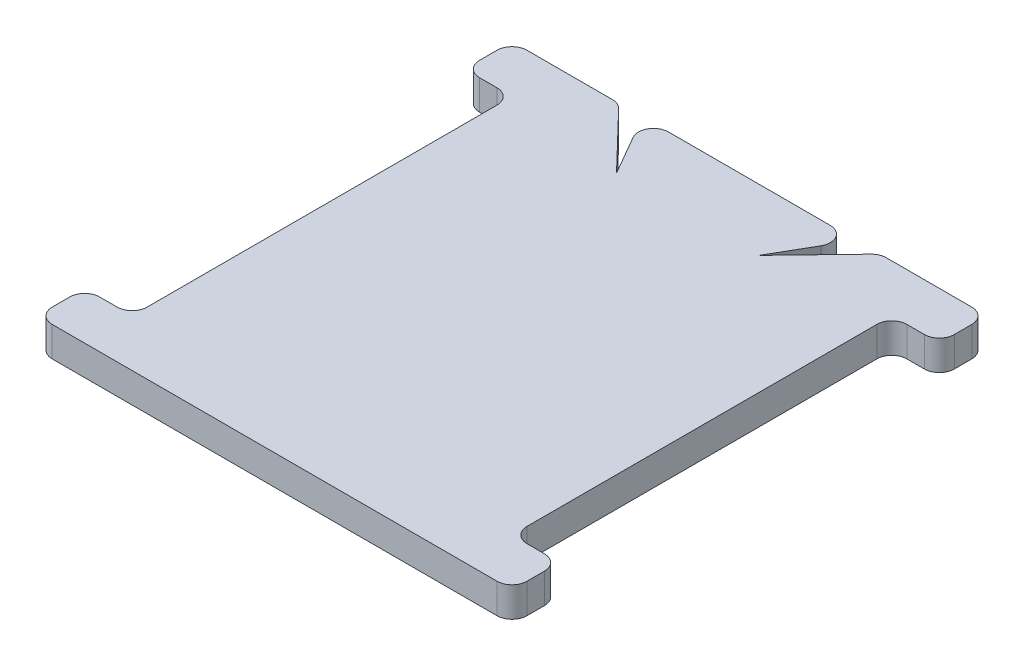
ISO-10303-21;
HEADER;
FILE_DESCRIPTION(('STEP AP214'),'2;1');
FILE_NAME('part.step','',(''),(''),'','','');
FILE_SCHEMA(('AUTOMOTIVE_DESIGN { 1 0 10303 214 1 1 1 1 }'));
ENDSEC;
DATA;
#1=APPLICATION_CONTEXT('core data for automotive mechanical design processes');
#2=APPLICATION_PROTOCOL_DEFINITION('international standard','automotive_design',2000,#1);
#3=PRODUCT_CONTEXT('',#1,'mechanical');
#4=PRODUCT('Part','Part','',(#3));
#5=PRODUCT_RELATED_PRODUCT_CATEGORY('part','',(#4));
#6=PRODUCT_DEFINITION_FORMATION('','',#4);
#7=PRODUCT_DEFINITION_CONTEXT('part definition',#1,'design');
#8=PRODUCT_DEFINITION('design','',#6,#7);
#9=PRODUCT_DEFINITION_SHAPE('','',#8);
#10=(LENGTH_UNIT() NAMED_UNIT(*) SI_UNIT(.MILLI.,.METRE.));
#11=(NAMED_UNIT(*) PLANE_ANGLE_UNIT() SI_UNIT($,.RADIAN.));
#12=(NAMED_UNIT(*) SI_UNIT($,.STERADIAN.) SOLID_ANGLE_UNIT());
#13=UNCERTAINTY_MEASURE_WITH_UNIT(LENGTH_MEASURE(1.E-05),#10,'distance_accuracy_value','');
#14=(GEOMETRIC_REPRESENTATION_CONTEXT(3) GLOBAL_UNCERTAINTY_ASSIGNED_CONTEXT((#13)) GLOBAL_UNIT_ASSIGNED_CONTEXT((#10,
#11,#12)) REPRESENTATION_CONTEXT('',''));
#15=CARTESIAN_POINT('',(0.,0.,0.));
#16=DIRECTION('',(0.,0.,1.));
#17=DIRECTION('',(1.,0.,0.));
#18=AXIS2_PLACEMENT_3D('',#15,#16,#17);
#19=CARTESIAN_POINT('',(-15.875,1.,-15.875));
#20=DIRECTION('',(0.,0.,1.));
#21=DIRECTION('',(1.,0.,0.));
#22=AXIS2_PLACEMENT_3D('',#19,#20,#21);
#23=PLANE('',#22);
#24=DIRECTION('',(-1.,0.,0.));
#25=VECTOR('',#24,1.);
#26=CARTESIAN_POINT('',(-15.875,-1.,-15.875));
#27=LINE('',#26,#25);
#28=CARTESIAN_POINT('',(14.875,-1.,-15.875));
#29=VERTEX_POINT('',#28);
#30=CARTESIAN_POINT('',(9.15677688432803,-1.,-15.875));
#31=VERTEX_POINT('',#30);
#32=EDGE_CURVE('E343',#29,#31,#27,.T.);
#33=ORIENTED_EDGE('',*,*,#32,.T.);
#34=DIRECTION('',(0.,1.,0.));
#35=VECTOR('',#34,1.);
#36=CARTESIAN_POINT('',(9.15677688432803,1.,-15.875));
#37=LINE('',#36,#35);
#38=CARTESIAN_POINT('',(9.15677688432803,1.,-15.875));
#39=VERTEX_POINT('',#38);
#40=EDGE_CURVE('E41',#31,#39,#37,.T.);
#41=ORIENTED_EDGE('',*,*,#40,.T.);
#42=DIRECTION('',(-1.,0.,0.));
#43=VECTOR('',#42,1.);
#44=CARTESIAN_POINT('',(-15.875,1.,-15.875));
#45=LINE('',#44,#43);
#46=CARTESIAN_POINT('',(14.875,1.,-15.875));
#47=VERTEX_POINT('',#46);
#48=EDGE_CURVE('E341',#47,#39,#45,.T.);
#49=ORIENTED_EDGE('',*,*,#48,.F.);
#50=DIRECTION('',(0.,-1.,0.));
#51=VECTOR('',#50,1.);
#52=CARTESIAN_POINT('',(14.875,1.,-15.875));
#53=LINE('',#52,#51);
#54=EDGE_CURVE('E422',#47,#29,#53,.T.);
#55=ORIENTED_EDGE('',*,*,#54,.T.);
#56=EDGE_LOOP('',(#33,#41,#49,#55));
#57=FACE_BOUND('',#56,.T.);
#58=ADVANCED_FACE('F33',(#57),#23,.F.);
#59=CARTESIAN_POINT('',(5.41169919243111,1.,-15.875));
#60=VERTEX_POINT('',#59);
#61=CARTESIAN_POINT('',(-5.41169919243112,1.,-15.875));
#62=VERTEX_POINT('',#61);
#63=EDGE_CURVE('E349',#60,#62,#45,.T.);
#64=ORIENTED_EDGE('',*,*,#63,.F.);
#65=DIRECTION('',(0.,1.,0.));
#66=VECTOR('',#65,1.);
#67=CARTESIAN_POINT('',(5.41169919243112,-1.,-15.875));
#68=LINE('',#67,#66);
#69=CARTESIAN_POINT('',(5.41169919243111,-1.,-15.875));
#70=VERTEX_POINT('',#69);
#71=EDGE_CURVE('E332',#60,#70,#68,.F.);
#72=ORIENTED_EDGE('',*,*,#71,.T.);
#73=CARTESIAN_POINT('',(-5.41169919243112,-1.,-15.875));
#74=VERTEX_POINT('',#73);
#75=EDGE_CURVE('E492',#70,#74,#27,.T.);
#76=ORIENTED_EDGE('',*,*,#75,.T.);
#77=DIRECTION('',(0.,1.,0.));
#78=VECTOR('',#77,1.);
#79=CARTESIAN_POINT('',(-5.41169919243112,1.,-15.875));
#80=LINE('',#79,#78);
#81=EDGE_CURVE('E303',#74,#62,#80,.T.);
#82=ORIENTED_EDGE('',*,*,#81,.T.);
#83=EDGE_LOOP('',(#64,#72,#76,#82));
#84=FACE_BOUND('',#83,.T.);
#85=ADVANCED_FACE('F489',(#84),#23,.F.);
#86=CARTESIAN_POINT('',(0.,1.,0.));
#87=DIRECTION('',(0.,-1.,0.));
#88=DIRECTION('',(0.,0.,-1.));
#89=AXIS2_PLACEMENT_3D('',#86,#87,#88);
#90=PLANE('',#89);
#91=DIRECTION('',(-0.499999999999998,0.,0.86602540378444));
#92=VECTOR('',#91,1.);
#93=CARTESIAN_POINT('',(-1.51626414253896,1.,-0.875415510857439));
#94=LINE('',#93,#92);
#95=CARTESIAN_POINT('',(6.27772459621556,1.,-14.375));
#96=VERTEX_POINT('',#95);
#97=CARTESIAN_POINT('',(4.7625,1.0000025,-11.7505540144766));
#98=VERTEX_POINT('',#97);
#99=EDGE_CURVE('E256',#96,#98,#94,.T.);
#100=ORIENTED_EDGE('',*,*,#99,.F.);
#101=CARTESIAN_POINT('',(5.41169919243112,1.,-14.875));
#102=DIRECTION('',(0.,-1.,0.));
#103=DIRECTION('',(0.,0.,-1.));
#104=AXIS2_PLACEMENT_3D('',#101,#102,#103);
#105=CIRCLE('',#104,1.);
#106=EDGE_CURVE('E330',#96,#60,#105,.F.);
#107=ORIENTED_EDGE('',*,*,#106,.T.);
#108=ORIENTED_EDGE('',*,*,#63,.T.);
#109=CARTESIAN_POINT('',(-5.41169919243112,1.,-14.875));
#110=DIRECTION('',(0.,-1.,0.));
#111=DIRECTION('',(0.,0.,-1.));
#112=AXIS2_PLACEMENT_3D('',#109,#110,#111);
#113=CIRCLE('',#112,1.);
#114=CARTESIAN_POINT('',(-6.27772459621556,1.,-14.375));
#115=VERTEX_POINT('',#114);
#116=EDGE_CURVE('E307',#62,#115,#113,.F.);
#117=ORIENTED_EDGE('',*,*,#116,.T.);
#118=DIRECTION('',(0.499999999999998,0.,0.86602540378444));
#119=VECTOR('',#118,1.);
#120=CARTESIAN_POINT('',(1.51626414253895,1.,-0.875415510857438));
#121=LINE('',#120,#119);
#122=CARTESIAN_POINT('',(-4.7625,1.,-11.7505540144766));
#123=VERTEX_POINT('',#122);
#124=EDGE_CURVE('E292',#115,#123,#121,.T.);
#125=ORIENTED_EDGE('',*,*,#124,.T.);
#126=DIRECTION('',(-0.693375245281535,0.,-0.720576692122894));
#127=VECTOR('',#126,1.);
#128=CARTESIAN_POINT('',(3.39809324139112,1.,-3.269816746081));
#129=LINE('',#128,#127);
#130=CARTESIAN_POINT('',(-8.43620019220515,1.,-15.5683752452815));
#131=VERTEX_POINT('',#130);
#132=EDGE_CURVE('E287',#123,#131,#129,.T.);
#133=ORIENTED_EDGE('',*,*,#132,.T.);
#134=CARTESIAN_POINT('',(-9.15677688432803,1.,-14.875));
#135=DIRECTION('',(0.,-1.,0.));
#136=DIRECTION('',(0.,0.,-1.));
#137=AXIS2_PLACEMENT_3D('',#134,#135,#136);
#138=CIRCLE('',#137,1.);
#139=CARTESIAN_POINT('',(-9.15677688432804,1.,-15.875));
#140=VERTEX_POINT('',#139);
#141=EDGE_CURVE('E305',#131,#140,#138,.F.);
#142=ORIENTED_EDGE('',*,*,#141,.T.);
#143=CARTESIAN_POINT('',(-14.875,1.,-15.875));
#144=VERTEX_POINT('',#143);
#145=EDGE_CURVE('E351',#140,#144,#45,.T.);
#146=ORIENTED_EDGE('',*,*,#145,.T.);
#147=CARTESIAN_POINT('',(-14.875,1.,-14.875));
#148=DIRECTION('',(0.,-1.,0.));
#149=DIRECTION('',(0.,0.,-1.));
#150=AXIS2_PLACEMENT_3D('',#147,#148,#149);
#151=CIRCLE('',#150,1.);
#152=CARTESIAN_POINT('',(-15.875,1.,-14.875));
#153=VERTEX_POINT('',#152);
#154=EDGE_CURVE('E439',#144,#153,#151,.F.);
#155=ORIENTED_EDGE('',*,*,#154,.T.);
#156=DIRECTION('',(0.,0.,1.));
#157=VECTOR('',#156,1.);
#158=CARTESIAN_POINT('',(-15.875,1.,-15.875));
#159=LINE('',#158,#157);
#160=CARTESIAN_POINT('',(-15.875,1.,-13.7));
#161=VERTEX_POINT('',#160);
#162=EDGE_CURVE('E348',#153,#161,#159,.T.);
#163=ORIENTED_EDGE('',*,*,#162,.T.);
#164=CARTESIAN_POINT('',(-14.875,1.,-13.7));
#165=DIRECTION('',(0.,-1.,0.));
#166=DIRECTION('',(0.,0.,-1.));
#167=AXIS2_PLACEMENT_3D('',#164,#165,#166);
#168=CIRCLE('',#167,1.);
#169=CARTESIAN_POINT('',(-14.875,1.,-12.7));
#170=VERTEX_POINT('',#169);
#171=EDGE_CURVE('E435',#161,#170,#168,.F.);
#172=ORIENTED_EDGE('',*,*,#171,.T.);
#173=DIRECTION('',(1.,0.,0.));
#174=VECTOR('',#173,1.);
#175=CARTESIAN_POINT('',(-15.875,1.,-12.7));
#176=LINE('',#175,#174);
#177=CARTESIAN_POINT('',(-13.7,1.,-12.7));
#178=VERTEX_POINT('',#177);
#179=EDGE_CURVE('E353',#170,#178,#176,.T.);
#180=ORIENTED_EDGE('',*,*,#179,.T.);
#181=CARTESIAN_POINT('',(-13.7,1.,-11.7));
#182=DIRECTION('',(0.,-1.,0.));
#183=DIRECTION('',(0.,0.,-1.));
#184=AXIS2_PLACEMENT_3D('',#181,#182,#183);
#185=CIRCLE('',#184,1.);
#186=CARTESIAN_POINT('',(-12.7,1.,-11.7));
#187=VERTEX_POINT('',#186);
#188=EDGE_CURVE('E473',#178,#187,#185,.T.);
#189=ORIENTED_EDGE('',*,*,#188,.T.);
#190=DIRECTION('',(0.,0.,1.));
#191=VECTOR('',#190,1.);
#192=CARTESIAN_POINT('',(-12.7,1.,12.7));
#193=LINE('',#192,#191);
#194=CARTESIAN_POINT('',(-12.7,1.,11.7));
#195=VERTEX_POINT('',#194);
#196=EDGE_CURVE('E721',#187,#195,#193,.T.);
#197=ORIENTED_EDGE('',*,*,#196,.T.);
#198=CARTESIAN_POINT('',(-13.7,1.,11.7));
#199=DIRECTION('',(0.,-1.,0.));
#200=DIRECTION('',(0.,0.,-1.));
#201=AXIS2_PLACEMENT_3D('',#198,#199,#200);
#202=CIRCLE('',#201,1.);
#203=CARTESIAN_POINT('',(-13.7,1.,12.7));
#204=VERTEX_POINT('',#203);
#205=EDGE_CURVE('E481',#195,#204,#202,.T.);
#206=ORIENTED_EDGE('',*,*,#205,.T.);
#207=DIRECTION('',(-1.,0.,0.));
#208=VECTOR('',#207,1.);
#209=CARTESIAN_POINT('',(-15.875,1.,12.7));
#210=LINE('',#209,#208);
#211=CARTESIAN_POINT('',(-14.875,1.,12.7));
#212=VERTEX_POINT('',#211);
#213=EDGE_CURVE('E725',#204,#212,#210,.T.);
#214=ORIENTED_EDGE('',*,*,#213,.T.);
#215=CARTESIAN_POINT('',(-14.875,1.,13.7));
#216=DIRECTION('',(0.,-1.,0.));
#217=DIRECTION('',(0.,0.,-1.));
#218=AXIS2_PLACEMENT_3D('',#215,#216,#217);
#219=CIRCLE('',#218,1.);
#220=CARTESIAN_POINT('',(-15.875,1.,13.7));
#221=VERTEX_POINT('',#220);
#222=EDGE_CURVE('E437',#212,#221,#219,.F.);
#223=ORIENTED_EDGE('',*,*,#222,.T.);
#224=DIRECTION('',(0.,0.,1.));
#225=VECTOR('',#224,1.);
#226=CARTESIAN_POINT('',(-15.875,1.,12.7));
#227=LINE('',#226,#225);
#228=CARTESIAN_POINT('',(-15.875,1.,14.875));
#229=VERTEX_POINT('',#228);
#230=EDGE_CURVE('E566',#221,#229,#227,.T.);
#231=ORIENTED_EDGE('',*,*,#230,.T.);
#232=CARTESIAN_POINT('',(-14.875,1.,14.875));
#233=DIRECTION('',(0.,-1.,0.));
#234=DIRECTION('',(0.,0.,-1.));
#235=AXIS2_PLACEMENT_3D('',#232,#233,#234);
#236=CIRCLE('',#235,1.);
#237=CARTESIAN_POINT('',(-14.875,1.,15.875));
#238=VERTEX_POINT('',#237);
#239=EDGE_CURVE('E433',#229,#238,#236,.F.);
#240=ORIENTED_EDGE('',*,*,#239,.T.);
#241=DIRECTION('',(1.,0.,0.));
#242=VECTOR('',#241,1.);
#243=CARTESIAN_POINT('',(-15.875,1.,15.875));
#244=LINE('',#243,#242);
#245=CARTESIAN_POINT('',(14.875,1.,15.875));
#246=VERTEX_POINT('',#245);
#247=EDGE_CURVE('E558',#238,#246,#244,.T.);
#248=ORIENTED_EDGE('',*,*,#247,.T.);
#249=CARTESIAN_POINT('',(14.875,1.,14.875));
#250=DIRECTION('',(0.,-1.,0.));
#251=DIRECTION('',(0.,0.,-1.));
#252=AXIS2_PLACEMENT_3D('',#249,#250,#251);
#253=CIRCLE('',#252,1.);
#254=CARTESIAN_POINT('',(15.875,1.,14.875));
#255=VERTEX_POINT('',#254);
#256=EDGE_CURVE('E429',#246,#255,#253,.F.);
#257=ORIENTED_EDGE('',*,*,#256,.T.);
#258=DIRECTION('',(0.,0.,-1.));
#259=VECTOR('',#258,1.);
#260=CARTESIAN_POINT('',(15.875,1.,12.7));
#261=LINE('',#260,#259);
#262=CARTESIAN_POINT('',(15.875,1.,13.7));
#263=VERTEX_POINT('',#262);
#264=EDGE_CURVE('E556',#255,#263,#261,.T.);
#265=ORIENTED_EDGE('',*,*,#264,.T.);
#266=CARTESIAN_POINT('',(14.875,1.,13.7));
#267=DIRECTION('',(0.,-1.,0.));
#268=DIRECTION('',(0.,0.,-1.));
#269=AXIS2_PLACEMENT_3D('',#266,#267,#268);
#270=CIRCLE('',#269,1.);
#271=CARTESIAN_POINT('',(14.875,1.,12.7));
#272=VERTEX_POINT('',#271);
#273=EDGE_CURVE('E431',#263,#272,#270,.F.);
#274=ORIENTED_EDGE('',*,*,#273,.T.);
#275=DIRECTION('',(-1.,0.,0.));
#276=VECTOR('',#275,1.);
#277=CARTESIAN_POINT('',(12.7,1.,12.7));
#278=LINE('',#277,#276);
#279=CARTESIAN_POINT('',(13.7,1.,12.7));
#280=VERTEX_POINT('',#279);
#281=EDGE_CURVE('E383',#272,#280,#278,.T.);
#282=ORIENTED_EDGE('',*,*,#281,.T.);
#283=CARTESIAN_POINT('',(13.7,1.,11.7));
#284=DIRECTION('',(0.,-1.,0.));
#285=DIRECTION('',(0.,0.,-1.));
#286=AXIS2_PLACEMENT_3D('',#283,#284,#285);
#287=CIRCLE('',#286,1.);
#288=CARTESIAN_POINT('',(12.7,1.,11.7));
#289=VERTEX_POINT('',#288);
#290=EDGE_CURVE('E477',#280,#289,#287,.T.);
#291=ORIENTED_EDGE('',*,*,#290,.T.);
#292=DIRECTION('',(0.,0.,-1.));
#293=VECTOR('',#292,1.);
#294=CARTESIAN_POINT('',(12.7,1.,12.7));
#295=LINE('',#294,#293);
#296=CARTESIAN_POINT('',(12.7,1.,-11.7));
#297=VERTEX_POINT('',#296);
#298=EDGE_CURVE('E297',#289,#297,#295,.T.);
#299=ORIENTED_EDGE('',*,*,#298,.T.);
#300=CARTESIAN_POINT('',(13.7,1.,-11.7));
#301=DIRECTION('',(0.,-1.,0.));
#302=DIRECTION('',(0.,0.,-1.));
#303=AXIS2_PLACEMENT_3D('',#300,#301,#302);
#304=CIRCLE('',#303,1.);
#305=CARTESIAN_POINT('',(13.7,1.,-12.7));
#306=VERTEX_POINT('',#305);
#307=EDGE_CURVE('E484',#297,#306,#304,.T.);
#308=ORIENTED_EDGE('',*,*,#307,.T.);
#309=DIRECTION('',(1.,0.,0.));
#310=VECTOR('',#309,1.);
#311=CARTESIAN_POINT('',(12.7,1.,-12.7));
#312=LINE('',#311,#310);
#313=CARTESIAN_POINT('',(14.875,1.,-12.7));
#314=VERTEX_POINT('',#313);
#315=EDGE_CURVE('E359',#306,#314,#312,.T.);
#316=ORIENTED_EDGE('',*,*,#315,.T.);
#317=CARTESIAN_POINT('',(14.875,1.,-13.7));
#318=DIRECTION('',(0.,-1.,0.));
#319=DIRECTION('',(0.,0.,-1.));
#320=AXIS2_PLACEMENT_3D('',#317,#318,#319);
#321=CIRCLE('',#320,1.);
#322=CARTESIAN_POINT('',(15.875,1.,-13.7));
#323=VERTEX_POINT('',#322);
#324=EDGE_CURVE('E426',#314,#323,#321,.F.);
#325=ORIENTED_EDGE('',*,*,#324,.T.);
#326=DIRECTION('',(0.,0.,-1.));
#327=VECTOR('',#326,1.);
#328=CARTESIAN_POINT('',(15.875,1.,-15.875));
#329=LINE('',#328,#327);
#330=CARTESIAN_POINT('',(15.875,1.,-14.875));
#331=VERTEX_POINT('',#330);
#332=EDGE_CURVE('E356',#323,#331,#329,.T.);
#333=ORIENTED_EDGE('',*,*,#332,.T.);
#334=CARTESIAN_POINT('',(14.875,1.,-14.875));
#335=DIRECTION('',(0.,-1.,0.));
#336=DIRECTION('',(0.,0.,-1.));
#337=AXIS2_PLACEMENT_3D('',#334,#335,#336);
#338=CIRCLE('',#337,1.);
#339=EDGE_CURVE('E347',#331,#47,#338,.F.);
#340=ORIENTED_EDGE('',*,*,#339,.T.);
#341=ORIENTED_EDGE('',*,*,#48,.T.);
#342=CARTESIAN_POINT('',(9.15677688432803,1.,-14.875));
#343=DIRECTION('',(0.,-1.,0.));
#344=DIRECTION('',(0.,0.,-1.));
#345=AXIS2_PLACEMENT_3D('',#342,#343,#344);
#346=CIRCLE('',#345,1.);
#347=CARTESIAN_POINT('',(8.43620019220515,1.,-15.5683752452815));
#348=VERTEX_POINT('',#347);
#349=EDGE_CURVE('E272',#39,#348,#346,.F.);
#350=ORIENTED_EDGE('',*,*,#349,.T.);
#351=DIRECTION('',(0.693375245281535,0.,-0.720576692122894));
#352=VECTOR('',#351,1.);
#353=CARTESIAN_POINT('',(-3.39809324139112,1.,-3.269816746081));
#354=LINE('',#353,#352);
#355=EDGE_CURVE('E265',#98,#348,#354,.T.);
#356=ORIENTED_EDGE('',*,*,#355,.F.);
#357=EDGE_LOOP('',(#100,#107,#108,#117,#125,#133,#142,#146,#155,#163,#172,#180,#189,#197,#206,
#214,#223,#231,#240,#248,#257,#265,#274,#282,#291,#299,#308,#316,#325,#333,#340,#341,#350,#356));
#358=FACE_BOUND('',#357,.T.);
#359=ADVANCED_FACE('F270',(#358),#90,.F.);
#360=CARTESIAN_POINT('',(0.,-1.,0.));
#361=DIRECTION('',(0.,-1.,0.));
#362=DIRECTION('',(0.,0.,-1.));
#363=AXIS2_PLACEMENT_3D('',#360,#361,#362);
#364=PLANE('',#363);
#365=ORIENTED_EDGE('',*,*,#75,.F.);
#366=CARTESIAN_POINT('',(5.41169919243112,-1.,-14.875));
#367=DIRECTION('',(0.,-1.,0.));
#368=DIRECTION('',(0.,0.,-1.));
#369=AXIS2_PLACEMENT_3D('',#366,#367,#368);
#370=CIRCLE('',#369,1.);
#371=CARTESIAN_POINT('',(6.27772459621556,-1.,-14.375));
#372=VERTEX_POINT('',#371);
#373=EDGE_CURVE('E335',#70,#372,#370,.T.);
#374=ORIENTED_EDGE('',*,*,#373,.T.);
#375=DIRECTION('',(-0.499999999999998,0.,0.86602540378444));
#376=VECTOR('',#375,1.);
#377=CARTESIAN_POINT('',(-1.51626414253896,-1.,-0.875415510857439));
#378=LINE('',#377,#376);
#379=CARTESIAN_POINT('',(4.7625,-1.0000025,-11.7505540144766));
#380=VERTEX_POINT('',#379);
#381=EDGE_CURVE('E321',#372,#380,#378,.T.);
#382=ORIENTED_EDGE('',*,*,#381,.T.);
#383=DIRECTION('',(0.693375245281535,0.,-0.720576692122894));
#384=VECTOR('',#383,1.);
#385=CARTESIAN_POINT('',(-3.39809324139112,-1.,-3.269816746081));
#386=LINE('',#385,#384);
#387=CARTESIAN_POINT('',(8.43620019220515,-1.,-15.5683752452815));
#388=VERTEX_POINT('',#387);
#389=EDGE_CURVE('E268',#380,#388,#386,.T.);
#390=ORIENTED_EDGE('',*,*,#389,.T.);
#391=CARTESIAN_POINT('',(9.15677688432803,-1.,-14.875));
#392=DIRECTION('',(0.,-1.,0.));
#393=DIRECTION('',(0.,0.,-1.));
#394=AXIS2_PLACEMENT_3D('',#391,#392,#393);
#395=CIRCLE('',#394,1.);
#396=EDGE_CURVE('E48',#388,#31,#395,.T.);
#397=ORIENTED_EDGE('',*,*,#396,.T.);
#398=ORIENTED_EDGE('',*,*,#32,.F.);
#399=CARTESIAN_POINT('',(14.875,-1.,-14.875));
#400=DIRECTION('',(0.,-1.,0.));
#401=DIRECTION('',(0.,0.,-1.));
#402=AXIS2_PLACEMENT_3D('',#399,#400,#401);
#403=CIRCLE('',#402,1.);
#404=CARTESIAN_POINT('',(15.875,-1.,-14.875));
#405=VERTEX_POINT('',#404);
#406=EDGE_CURVE('E407',#29,#405,#403,.T.);
#407=ORIENTED_EDGE('',*,*,#406,.T.);
#408=DIRECTION('',(0.,0.,-1.));
#409=VECTOR('',#408,1.);
#410=CARTESIAN_POINT('',(15.875,-1.,-15.875));
#411=LINE('',#410,#409);
#412=CARTESIAN_POINT('',(15.875,-1.,-13.7));
#413=VERTEX_POINT('',#412);
#414=EDGE_CURVE('E520',#413,#405,#411,.T.);
#415=ORIENTED_EDGE('',*,*,#414,.F.);
#416=CARTESIAN_POINT('',(14.875,-1.,-13.7));
#417=DIRECTION('',(0.,-1.,0.));
#418=DIRECTION('',(0.,0.,-1.));
#419=AXIS2_PLACEMENT_3D('',#416,#417,#418);
#420=CIRCLE('',#419,1.);
#421=CARTESIAN_POINT('',(14.875,-1.,-12.7));
#422=VERTEX_POINT('',#421);
#423=EDGE_CURVE('E405',#413,#422,#420,.T.);
#424=ORIENTED_EDGE('',*,*,#423,.T.);
#425=DIRECTION('',(1.,0.,0.));
#426=VECTOR('',#425,1.);
#427=CARTESIAN_POINT('',(12.7,-1.,-12.7));
#428=LINE('',#427,#426);
#429=CARTESIAN_POINT('',(13.7,-1.,-12.7));
#430=VERTEX_POINT('',#429);
#431=EDGE_CURVE('E523',#430,#422,#428,.T.);
#432=ORIENTED_EDGE('',*,*,#431,.F.);
#433=CARTESIAN_POINT('',(13.7,-1.,-11.7));
#434=DIRECTION('',(0.,-1.,0.));
#435=DIRECTION('',(0.,0.,-1.));
#436=AXIS2_PLACEMENT_3D('',#433,#434,#435);
#437=CIRCLE('',#436,1.);
#438=CARTESIAN_POINT('',(12.7,-1.,-11.7));
#439=VERTEX_POINT('',#438);
#440=EDGE_CURVE('E483',#430,#439,#437,.F.);
#441=ORIENTED_EDGE('',*,*,#440,.T.);
#442=DIRECTION('',(0.,0.,-1.));
#443=VECTOR('',#442,1.);
#444=CARTESIAN_POINT('',(12.7,-1.,12.7));
#445=LINE('',#444,#443);
#446=CARTESIAN_POINT('',(12.7,-1.,11.7));
#447=VERTEX_POINT('',#446);
#448=EDGE_CURVE('E302',#447,#439,#445,.T.);
#449=ORIENTED_EDGE('',*,*,#448,.F.);
#450=CARTESIAN_POINT('',(13.7,-1.,11.7));
#451=DIRECTION('',(0.,-1.,0.));
#452=DIRECTION('',(0.,0.,-1.));
#453=AXIS2_PLACEMENT_3D('',#450,#451,#452);
#454=CIRCLE('',#453,1.);
#455=CARTESIAN_POINT('',(13.7,-1.,12.7));
#456=VERTEX_POINT('',#455);
#457=EDGE_CURVE('E475',#447,#456,#454,.F.);
#458=ORIENTED_EDGE('',*,*,#457,.T.);
#459=DIRECTION('',(-1.,0.,0.));
#460=VECTOR('',#459,1.);
#461=CARTESIAN_POINT('',(12.7,-1.,12.7));
#462=LINE('',#461,#460);
#463=CARTESIAN_POINT('',(14.875,-1.,12.7));
#464=VERTEX_POINT('',#463);
#465=EDGE_CURVE('E365',#464,#456,#462,.T.);
#466=ORIENTED_EDGE('',*,*,#465,.F.);
#467=CARTESIAN_POINT('',(14.875,-1.,13.7));
#468=DIRECTION('',(0.,-1.,0.));
#469=DIRECTION('',(0.,0.,-1.));
#470=AXIS2_PLACEMENT_3D('',#467,#468,#469);
#471=CIRCLE('',#470,1.);
#472=CARTESIAN_POINT('',(15.875,-1.,13.7));
#473=VERTEX_POINT('',#472);
#474=EDGE_CURVE('E411',#464,#473,#471,.T.);
#475=ORIENTED_EDGE('',*,*,#474,.T.);
#476=DIRECTION('',(0.,0.,-1.));
#477=VECTOR('',#476,1.);
#478=CARTESIAN_POINT('',(15.875,-1.,12.7));
#479=LINE('',#478,#477);
#480=CARTESIAN_POINT('',(15.875,-1.,14.875));
#481=VERTEX_POINT('',#480);
#482=EDGE_CURVE('E369',#481,#473,#479,.T.);
#483=ORIENTED_EDGE('',*,*,#482,.F.);
#484=CARTESIAN_POINT('',(14.875,-1.,14.875));
#485=DIRECTION('',(0.,-1.,0.));
#486=DIRECTION('',(0.,0.,-1.));
#487=AXIS2_PLACEMENT_3D('',#484,#485,#486);
#488=CIRCLE('',#487,1.);
#489=CARTESIAN_POINT('',(14.875,-1.,15.875));
#490=VERTEX_POINT('',#489);
#491=EDGE_CURVE('E409',#481,#490,#488,.T.);
#492=ORIENTED_EDGE('',*,*,#491,.T.);
#493=DIRECTION('',(1.,0.,0.));
#494=VECTOR('',#493,1.);
#495=CARTESIAN_POINT('',(-15.875,-1.,15.875));
#496=LINE('',#495,#494);
#497=CARTESIAN_POINT('',(-14.875,-1.,15.875));
#498=VERTEX_POINT('',#497);
#499=EDGE_CURVE('E376',#498,#490,#496,.T.);
#500=ORIENTED_EDGE('',*,*,#499,.F.);
#501=CARTESIAN_POINT('',(-14.875,-1.,14.875));
#502=DIRECTION('',(0.,-1.,0.));
#503=DIRECTION('',(0.,0.,-1.));
#504=AXIS2_PLACEMENT_3D('',#501,#502,#503);
#505=CIRCLE('',#504,1.);
#506=CARTESIAN_POINT('',(-15.875,-1.,14.875));
#507=VERTEX_POINT('',#506);
#508=EDGE_CURVE('E413',#498,#507,#505,.T.);
#509=ORIENTED_EDGE('',*,*,#508,.T.);
#510=DIRECTION('',(0.,0.,1.));
#511=VECTOR('',#510,1.);
#512=CARTESIAN_POINT('',(-15.875,-1.,12.7));
#513=LINE('',#512,#511);
#514=CARTESIAN_POINT('',(-15.875,-1.,13.7));
#515=VERTEX_POINT('',#514);
#516=EDGE_CURVE('E540',#515,#507,#513,.T.);
#517=ORIENTED_EDGE('',*,*,#516,.F.);
#518=CARTESIAN_POINT('',(-14.875,-1.,13.7));
#519=DIRECTION('',(0.,-1.,0.));
#520=DIRECTION('',(0.,0.,-1.));
#521=AXIS2_PLACEMENT_3D('',#518,#519,#520);
#522=CIRCLE('',#521,1.);
#523=CARTESIAN_POINT('',(-14.875,-1.,12.7));
#524=VERTEX_POINT('',#523);
#525=EDGE_CURVE('E417',#515,#524,#522,.T.);
#526=ORIENTED_EDGE('',*,*,#525,.T.);
#527=DIRECTION('',(-1.,0.,0.));
#528=VECTOR('',#527,1.);
#529=CARTESIAN_POINT('',(-15.875,-1.,12.7));
#530=LINE('',#529,#528);
#531=CARTESIAN_POINT('',(-13.7,-1.,12.7));
#532=VERTEX_POINT('',#531);
#533=EDGE_CURVE('E537',#532,#524,#530,.T.);
#534=ORIENTED_EDGE('',*,*,#533,.F.);
#535=CARTESIAN_POINT('',(-13.7,-1.,11.7));
#536=DIRECTION('',(0.,-1.,0.));
#537=DIRECTION('',(0.,0.,-1.));
#538=AXIS2_PLACEMENT_3D('',#535,#536,#537);
#539=CIRCLE('',#538,1.);
#540=CARTESIAN_POINT('',(-12.7,-1.,11.7));
#541=VERTEX_POINT('',#540);
#542=EDGE_CURVE('E479',#532,#541,#539,.F.);
#543=ORIENTED_EDGE('',*,*,#542,.T.);
#544=DIRECTION('',(0.,0.,1.));
#545=VECTOR('',#544,1.);
#546=CARTESIAN_POINT('',(-12.7,-1.,12.7));
#547=LINE('',#546,#545);
#548=CARTESIAN_POINT('',(-12.7,-1.,-11.7));
#549=VERTEX_POINT('',#548);
#550=EDGE_CURVE('E532',#549,#541,#547,.T.);
#551=ORIENTED_EDGE('',*,*,#550,.F.);
#552=CARTESIAN_POINT('',(-13.7,-1.,-11.7));
#553=DIRECTION('',(0.,-1.,0.));
#554=DIRECTION('',(0.,0.,-1.));
#555=AXIS2_PLACEMENT_3D('',#552,#553,#554);
#556=CIRCLE('',#555,1.);
#557=CARTESIAN_POINT('',(-13.7,-1.,-12.7));
#558=VERTEX_POINT('',#557);
#559=EDGE_CURVE('E471',#549,#558,#556,.F.);
#560=ORIENTED_EDGE('',*,*,#559,.T.);
#561=DIRECTION('',(1.,0.,0.));
#562=VECTOR('',#561,1.);
#563=CARTESIAN_POINT('',(-15.875,-1.,-12.7));
#564=LINE('',#563,#562);
#565=CARTESIAN_POINT('',(-14.875,-1.,-12.7));
#566=VERTEX_POINT('',#565);
#567=EDGE_CURVE('E528',#566,#558,#564,.T.);
#568=ORIENTED_EDGE('',*,*,#567,.F.);
#569=CARTESIAN_POINT('',(-14.875,-1.,-13.7));
#570=DIRECTION('',(0.,-1.,0.));
#571=DIRECTION('',(0.,0.,-1.));
#572=AXIS2_PLACEMENT_3D('',#569,#570,#571);
#573=CIRCLE('',#572,1.);
#574=CARTESIAN_POINT('',(-15.875,-1.,-13.7));
#575=VERTEX_POINT('',#574);
#576=EDGE_CURVE('E415',#566,#575,#573,.T.);
#577=ORIENTED_EDGE('',*,*,#576,.T.);
#578=DIRECTION('',(0.,0.,1.));
#579=VECTOR('',#578,1.);
#580=CARTESIAN_POINT('',(-15.875,-1.,-15.875));
#581=LINE('',#580,#579);
#582=CARTESIAN_POINT('',(-15.875,-1.,-14.875));
#583=VERTEX_POINT('',#582);
#584=EDGE_CURVE('E526',#583,#575,#581,.T.);
#585=ORIENTED_EDGE('',*,*,#584,.F.);
#586=CARTESIAN_POINT('',(-14.875,-1.,-14.875));
#587=DIRECTION('',(0.,-1.,0.));
#588=DIRECTION('',(0.,0.,-1.));
#589=AXIS2_PLACEMENT_3D('',#586,#587,#588);
#590=CIRCLE('',#589,1.);
#591=CARTESIAN_POINT('',(-14.875,-1.,-15.875));
#592=VERTEX_POINT('',#591);
#593=EDGE_CURVE('E419',#583,#592,#590,.T.);
#594=ORIENTED_EDGE('',*,*,#593,.T.);
#595=CARTESIAN_POINT('',(-9.15677688432804,-1.,-15.875));
#596=VERTEX_POINT('',#595);
#597=EDGE_CURVE('E518',#596,#592,#27,.T.);
#598=ORIENTED_EDGE('',*,*,#597,.F.);
#599=CARTESIAN_POINT('',(-9.15677688432803,-1.,-14.875));
#600=DIRECTION('',(0.,-1.,0.));
#601=DIRECTION('',(0.,0.,-1.));
#602=AXIS2_PLACEMENT_3D('',#599,#600,#601);
#603=CIRCLE('',#602,1.);
#604=CARTESIAN_POINT('',(-8.43620019220514,-1.,-15.5683752452815));
#605=VERTEX_POINT('',#604);
#606=EDGE_CURVE('E311',#596,#605,#603,.T.);
#607=ORIENTED_EDGE('',*,*,#606,.T.);
#608=DIRECTION('',(0.693375245281535,0.,0.720576692122893));
#609=VECTOR('',#608,1.);
#610=CARTESIAN_POINT('',(-8.73124999999999,-1.,-15.875));
#611=LINE('',#610,#609);
#612=CARTESIAN_POINT('',(-4.7625,-1.,-11.7505540144766));
#613=VERTEX_POINT('',#612);
#614=EDGE_CURVE('E273',#605,#613,#611,.T.);
#615=ORIENTED_EDGE('',*,*,#614,.T.);
#616=DIRECTION('',(-0.499999999999998,0.,-0.86602540378444));
#617=VECTOR('',#616,1.);
#618=CARTESIAN_POINT('',(-4.7625,-1.,-11.7505540144766));
#619=LINE('',#618,#617);
#620=CARTESIAN_POINT('',(-6.27772459621556,-1.,-14.375));
#621=VERTEX_POINT('',#620);
#622=EDGE_CURVE('E275',#613,#621,#619,.T.);
#623=ORIENTED_EDGE('',*,*,#622,.T.);
#624=CARTESIAN_POINT('',(-5.41169919243112,-1.,-14.875));
#625=DIRECTION('',(0.,-1.,0.));
#626=DIRECTION('',(0.,0.,-1.));
#627=AXIS2_PLACEMENT_3D('',#624,#625,#626);
#628=CIRCLE('',#627,1.);
#629=EDGE_CURVE('E313',#621,#74,#628,.T.);
#630=ORIENTED_EDGE('',*,*,#629,.T.);
#631=EDGE_LOOP('',(#365,#374,#382,#390,#397,#398,#407,#415,#424,#432,#441,#449,#458,#466,#475,
#483,#492,#500,#509,#517,#526,#534,#543,#551,#560,#568,#577,#585,#594,#598,#607,#615,#623,#630));
#632=FACE_BOUND('',#631,.T.);
#633=ADVANCED_FACE('F517',(#632),#364,.T.);
#634=CARTESIAN_POINT('',(12.7,1.,12.7));
#635=DIRECTION('',(-1.,0.,0.));
#636=DIRECTION('',(0.,0.,1.));
#637=AXIS2_PLACEMENT_3D('',#634,#635,#636);
#638=PLANE('',#637);
#639=ORIENTED_EDGE('',*,*,#298,.F.);
#640=DIRECTION('',(0.,-1.,0.));
#641=VECTOR('',#640,1.);
#642=CARTESIAN_POINT('',(12.7,-1.,11.7));
#643=LINE('',#642,#641);
#644=EDGE_CURVE('E393',#289,#447,#643,.T.);
#645=ORIENTED_EDGE('',*,*,#644,.T.);
#646=ORIENTED_EDGE('',*,*,#448,.T.);
#647=DIRECTION('',(0.,-1.,0.));
#648=VECTOR('',#647,1.);
#649=CARTESIAN_POINT('',(12.7,1.,-11.7));
#650=LINE('',#649,#648);
#651=EDGE_CURVE('E391',#439,#297,#650,.F.);
#652=ORIENTED_EDGE('',*,*,#651,.T.);
#653=EDGE_LOOP('',(#639,#645,#646,#652));
#654=FACE_BOUND('',#653,.T.);
#655=ADVANCED_FACE('F614',(#654),#638,.F.);
#656=CARTESIAN_POINT('',(12.7,1.,-12.7));
#657=DIRECTION('',(0.,0.,-1.));
#658=DIRECTION('',(-1.,0.,0.));
#659=AXIS2_PLACEMENT_3D('',#656,#657,#658);
#660=PLANE('',#659);
#661=ORIENTED_EDGE('',*,*,#431,.T.);
#662=DIRECTION('',(0.,-1.,0.));
#663=VECTOR('',#662,1.);
#664=CARTESIAN_POINT('',(14.875,1.,-12.7));
#665=LINE('',#664,#663);
#666=EDGE_CURVE('E469',#422,#314,#665,.F.);
#667=ORIENTED_EDGE('',*,*,#666,.T.);
#668=ORIENTED_EDGE('',*,*,#315,.F.);
#669=DIRECTION('',(0.,-1.,0.));
#670=VECTOR('',#669,1.);
#671=CARTESIAN_POINT('',(13.7,-1.,-12.7));
#672=LINE('',#671,#670);
#673=EDGE_CURVE('E466',#306,#430,#672,.T.);
#674=ORIENTED_EDGE('',*,*,#673,.T.);
#675=EDGE_LOOP('',(#661,#667,#668,#674));
#676=FACE_BOUND('',#675,.T.);
#677=ADVANCED_FACE('F576',(#676),#660,.F.);
#678=CARTESIAN_POINT('',(15.875,1.,-15.875));
#679=DIRECTION('',(-1.,0.,0.));
#680=DIRECTION('',(0.,0.,1.));
#681=AXIS2_PLACEMENT_3D('',#678,#679,#680);
#682=PLANE('',#681);
#683=ORIENTED_EDGE('',*,*,#414,.T.);
#684=DIRECTION('',(0.,-1.,0.));
#685=VECTOR('',#684,1.);
#686=CARTESIAN_POINT('',(15.875,1.,-14.875));
#687=LINE('',#686,#685);
#688=EDGE_CURVE('E464',#405,#331,#687,.F.);
#689=ORIENTED_EDGE('',*,*,#688,.T.);
#690=ORIENTED_EDGE('',*,*,#332,.F.);
#691=DIRECTION('',(0.,-1.,0.));
#692=VECTOR('',#691,1.);
#693=CARTESIAN_POINT('',(15.875,1.,-13.7));
#694=LINE('',#693,#692);
#695=EDGE_CURVE('E461',#323,#413,#694,.T.);
#696=ORIENTED_EDGE('',*,*,#695,.T.);
#697=EDGE_LOOP('',(#683,#689,#690,#696));
#698=FACE_BOUND('',#697,.T.);
#699=ADVANCED_FACE('F582',(#698),#682,.F.);
#700=ORIENTED_EDGE('',*,*,#145,.F.);
#701=DIRECTION('',(0.,1.,0.));
#702=VECTOR('',#701,1.);
#703=CARTESIAN_POINT('',(-9.15677688432803,1.,-15.875));
#704=LINE('',#703,#702);
#705=EDGE_CURVE('E319',#140,#596,#704,.F.);
#706=ORIENTED_EDGE('',*,*,#705,.T.);
#707=ORIENTED_EDGE('',*,*,#597,.T.);
#708=DIRECTION('',(0.,-1.,0.));
#709=VECTOR('',#708,1.);
#710=CARTESIAN_POINT('',(-14.875,1.,-15.875));
#711=LINE('',#710,#709);
#712=EDGE_CURVE('E424',#592,#144,#711,.F.);
#713=ORIENTED_EDGE('',*,*,#712,.T.);
#714=EDGE_LOOP('',(#700,#706,#707,#713));
#715=FACE_BOUND('',#714,.T.);
#716=ADVANCED_FACE('F511',(#715),#23,.F.);
#717=CARTESIAN_POINT('',(-15.875,1.,-15.875));
#718=DIRECTION('',(1.,0.,0.));
#719=DIRECTION('',(0.,0.,-1.));
#720=AXIS2_PLACEMENT_3D('',#717,#718,#719);
#721=PLANE('',#720);
#722=ORIENTED_EDGE('',*,*,#162,.F.);
#723=DIRECTION('',(0.,-1.,0.));
#724=VECTOR('',#723,1.);
#725=CARTESIAN_POINT('',(-15.875,1.,-14.875));
#726=LINE('',#725,#724);
#727=EDGE_CURVE('E402',#153,#583,#726,.T.);
#728=ORIENTED_EDGE('',*,*,#727,.T.);
#729=ORIENTED_EDGE('',*,*,#584,.T.);
#730=DIRECTION('',(0.,-1.,0.));
#731=VECTOR('',#730,1.);
#732=CARTESIAN_POINT('',(-15.875,1.,-13.7));
#733=LINE('',#732,#731);
#734=EDGE_CURVE('E400',#575,#161,#733,.F.);
#735=ORIENTED_EDGE('',*,*,#734,.T.);
#736=EDGE_LOOP('',(#722,#728,#729,#735));
#737=FACE_BOUND('',#736,.T.);
#738=ADVANCED_FACE('F605',(#737),#721,.F.);
#739=CARTESIAN_POINT('',(-15.875,1.,-12.7));
#740=DIRECTION('',(0.,0.,-1.));
#741=DIRECTION('',(-1.,0.,0.));
#742=AXIS2_PLACEMENT_3D('',#739,#740,#741);
#743=PLANE('',#742);
#744=ORIENTED_EDGE('',*,*,#567,.T.);
#745=DIRECTION('',(0.,-1.,0.));
#746=VECTOR('',#745,1.);
#747=CARTESIAN_POINT('',(-13.7,1.,-12.7));
#748=LINE('',#747,#746);
#749=EDGE_CURVE('E389',#558,#178,#748,.F.);
#750=ORIENTED_EDGE('',*,*,#749,.T.);
#751=ORIENTED_EDGE('',*,*,#179,.F.);
#752=DIRECTION('',(0.,-1.,0.));
#753=VECTOR('',#752,1.);
#754=CARTESIAN_POINT('',(-14.875,1.,-12.7));
#755=LINE('',#754,#753);
#756=EDGE_CURVE('E386',#170,#566,#755,.T.);
#757=ORIENTED_EDGE('',*,*,#756,.T.);
#758=EDGE_LOOP('',(#744,#750,#751,#757));
#759=FACE_BOUND('',#758,.T.);
#760=ADVANCED_FACE('F610',(#759),#743,.F.);
#761=CARTESIAN_POINT('',(-12.7,1.,12.7));
#762=DIRECTION('',(1.,0.,0.));
#763=DIRECTION('',(0.,0.,-1.));
#764=AXIS2_PLACEMENT_3D('',#761,#762,#763);
#765=PLANE('',#764);
#766=ORIENTED_EDGE('',*,*,#196,.F.);
#767=DIRECTION('',(0.,-1.,0.));
#768=VECTOR('',#767,1.);
#769=CARTESIAN_POINT('',(-12.7,-1.,-11.7));
#770=LINE('',#769,#768);
#771=EDGE_CURVE('E382',#187,#549,#770,.T.);
#772=ORIENTED_EDGE('',*,*,#771,.T.);
#773=ORIENTED_EDGE('',*,*,#550,.T.);
#774=DIRECTION('',(0.,-1.,0.));
#775=VECTOR('',#774,1.);
#776=CARTESIAN_POINT('',(-12.7,1.,11.7));
#777=LINE('',#776,#775);
#778=EDGE_CURVE('E380',#541,#195,#777,.F.);
#779=ORIENTED_EDGE('',*,*,#778,.T.);
#780=EDGE_LOOP('',(#766,#772,#773,#779));
#781=FACE_BOUND('',#780,.T.);
#782=ADVANCED_FACE('F703',(#781),#765,.F.);
#783=CARTESIAN_POINT('',(-15.875,1.,12.7));
#784=DIRECTION('',(0.,0.,1.));
#785=DIRECTION('',(1.,0.,0.));
#786=AXIS2_PLACEMENT_3D('',#783,#784,#785);
#787=PLANE('',#786);
#788=ORIENTED_EDGE('',*,*,#533,.T.);
#789=DIRECTION('',(0.,-1.,0.));
#790=VECTOR('',#789,1.);
#791=CARTESIAN_POINT('',(-14.875,1.,12.7));
#792=LINE('',#791,#790);
#793=EDGE_CURVE('E449',#524,#212,#792,.F.);
#794=ORIENTED_EDGE('',*,*,#793,.T.);
#795=ORIENTED_EDGE('',*,*,#213,.F.);
#796=DIRECTION('',(0.,-1.,0.));
#797=VECTOR('',#796,1.);
#798=CARTESIAN_POINT('',(-13.7,-1.,12.7));
#799=LINE('',#798,#797);
#800=EDGE_CURVE('E446',#204,#532,#799,.T.);
#801=ORIENTED_EDGE('',*,*,#800,.T.);
#802=EDGE_LOOP('',(#788,#794,#795,#801));
#803=FACE_BOUND('',#802,.T.);
#804=ADVANCED_FACE('F699',(#803),#787,.F.);
#805=CARTESIAN_POINT('',(-15.875,1.,12.7));
#806=DIRECTION('',(1.,0.,0.));
#807=DIRECTION('',(0.,0.,-1.));
#808=AXIS2_PLACEMENT_3D('',#805,#806,#807);
#809=PLANE('',#808);
#810=ORIENTED_EDGE('',*,*,#230,.F.);
#811=DIRECTION('',(0.,-1.,0.));
#812=VECTOR('',#811,1.);
#813=CARTESIAN_POINT('',(-15.875,1.,13.7));
#814=LINE('',#813,#812);
#815=EDGE_CURVE('E443',#221,#515,#814,.T.);
#816=ORIENTED_EDGE('',*,*,#815,.T.);
#817=ORIENTED_EDGE('',*,*,#516,.T.);
#818=DIRECTION('',(0.,-1.,0.));
#819=VECTOR('',#818,1.);
#820=CARTESIAN_POINT('',(-15.875,1.,14.875));
#821=LINE('',#820,#819);
#822=EDGE_CURVE('E441',#507,#229,#821,.F.);
#823=ORIENTED_EDGE('',*,*,#822,.T.);
#824=EDGE_LOOP('',(#810,#816,#817,#823));
#825=FACE_BOUND('',#824,.T.);
#826=ADVANCED_FACE('F696',(#825),#809,.F.);
#827=CARTESIAN_POINT('',(-15.875,1.,15.875));
#828=DIRECTION('',(0.,0.,-1.));
#829=DIRECTION('',(-1.,0.,0.));
#830=AXIS2_PLACEMENT_3D('',#827,#828,#829);
#831=PLANE('',#830);
#832=ORIENTED_EDGE('',*,*,#247,.F.);
#833=DIRECTION('',(0.,-1.,0.));
#834=VECTOR('',#833,1.);
#835=CARTESIAN_POINT('',(-14.875,1.,15.875));
#836=LINE('',#835,#834);
#837=EDGE_CURVE('E453',#238,#498,#836,.T.);
#838=ORIENTED_EDGE('',*,*,#837,.T.);
#839=ORIENTED_EDGE('',*,*,#499,.T.);
#840=DIRECTION('',(0.,-1.,0.));
#841=VECTOR('',#840,1.);
#842=CARTESIAN_POINT('',(14.875,1.,15.875));
#843=LINE('',#842,#841);
#844=EDGE_CURVE('E451',#490,#246,#843,.F.);
#845=ORIENTED_EDGE('',*,*,#844,.T.);
#846=EDGE_LOOP('',(#832,#838,#839,#845));
#847=FACE_BOUND('',#846,.T.);
#848=ADVANCED_FACE('F547',(#847),#831,.F.);
#849=CARTESIAN_POINT('',(15.875,1.,12.7));
#850=DIRECTION('',(-1.,0.,0.));
#851=DIRECTION('',(0.,0.,1.));
#852=AXIS2_PLACEMENT_3D('',#849,#850,#851);
#853=PLANE('',#852);
#854=ORIENTED_EDGE('',*,*,#482,.T.);
#855=DIRECTION('',(0.,-1.,0.));
#856=VECTOR('',#855,1.);
#857=CARTESIAN_POINT('',(15.875,1.,13.7));
#858=LINE('',#857,#856);
#859=EDGE_CURVE('E459',#473,#263,#858,.F.);
#860=ORIENTED_EDGE('',*,*,#859,.T.);
#861=ORIENTED_EDGE('',*,*,#264,.F.);
#862=DIRECTION('',(0.,-1.,0.));
#863=VECTOR('',#862,1.);
#864=CARTESIAN_POINT('',(15.875,1.,14.875));
#865=LINE('',#864,#863);
#866=EDGE_CURVE('E456',#255,#481,#865,.T.);
#867=ORIENTED_EDGE('',*,*,#866,.T.);
#868=EDGE_LOOP('',(#854,#860,#861,#867));
#869=FACE_BOUND('',#868,.T.);
#870=ADVANCED_FACE('F560',(#869),#853,.F.);
#871=CARTESIAN_POINT('',(12.7,1.,12.7));
#872=DIRECTION('',(0.,0.,1.));
#873=DIRECTION('',(1.,0.,0.));
#874=AXIS2_PLACEMENT_3D('',#871,#872,#873);
#875=PLANE('',#874);
#876=ORIENTED_EDGE('',*,*,#465,.T.);
#877=DIRECTION('',(0.,-1.,0.));
#878=VECTOR('',#877,1.);
#879=CARTESIAN_POINT('',(13.7,1.,12.7));
#880=LINE('',#879,#878);
#881=EDGE_CURVE('E398',#456,#280,#880,.F.);
#882=ORIENTED_EDGE('',*,*,#881,.T.);
#883=ORIENTED_EDGE('',*,*,#281,.F.);
#884=DIRECTION('',(0.,-1.,0.));
#885=VECTOR('',#884,1.);
#886=CARTESIAN_POINT('',(14.875,1.,12.7));
#887=LINE('',#886,#885);
#888=EDGE_CURVE('E396',#272,#464,#887,.T.);
#889=ORIENTED_EDGE('',*,*,#888,.T.);
#890=EDGE_LOOP('',(#876,#882,#883,#889));
#891=FACE_BOUND('',#890,.T.);
#892=ADVANCED_FACE('F624',(#891),#875,.F.);
#893=CARTESIAN_POINT('',(-13.7,1.,-11.7));
#894=DIRECTION('',(0.,1.,0.));
#895=DIRECTION('',(0.,0.,1.));
#896=AXIS2_PLACEMENT_3D('',#893,#894,#895);
#897=CYLINDRICAL_SURFACE('',#896,1.);
#898=ORIENTED_EDGE('',*,*,#188,.F.);
#899=ORIENTED_EDGE('',*,*,#749,.F.);
#900=ORIENTED_EDGE('',*,*,#559,.F.);
#901=ORIENTED_EDGE('',*,*,#771,.F.);
#902=EDGE_LOOP('',(#898,#899,#900,#901));
#903=FACE_BOUND('',#902,.T.);
#904=ADVANCED_FACE('F620',(#903),#897,.F.);
#905=CARTESIAN_POINT('',(13.7,1.,11.7));
#906=DIRECTION('',(0.,1.,0.));
#907=DIRECTION('',(0.,0.,1.));
#908=AXIS2_PLACEMENT_3D('',#905,#906,#907);
#909=CYLINDRICAL_SURFACE('',#908,1.);
#910=ORIENTED_EDGE('',*,*,#290,.F.);
#911=ORIENTED_EDGE('',*,*,#881,.F.);
#912=ORIENTED_EDGE('',*,*,#457,.F.);
#913=ORIENTED_EDGE('',*,*,#644,.F.);
#914=EDGE_LOOP('',(#910,#911,#912,#913));
#915=FACE_BOUND('',#914,.T.);
#916=ADVANCED_FACE('F623',(#915),#909,.F.);
#917=CARTESIAN_POINT('',(-14.875,1.,-14.875));
#918=DIRECTION('',(0.,-1.,0.));
#919=DIRECTION('',(0.,0.,-1.));
#920=AXIS2_PLACEMENT_3D('',#917,#918,#919);
#921=CYLINDRICAL_SURFACE('',#920,1.);
#922=ORIENTED_EDGE('',*,*,#154,.F.);
#923=ORIENTED_EDGE('',*,*,#712,.F.);
#924=ORIENTED_EDGE('',*,*,#593,.F.);
#925=ORIENTED_EDGE('',*,*,#727,.F.);
#926=EDGE_LOOP('',(#922,#923,#924,#925));
#927=FACE_BOUND('',#926,.T.);
#928=ADVANCED_FACE('F628',(#927),#921,.T.);
#929=CARTESIAN_POINT('',(-14.875,1.,13.7));
#930=DIRECTION('',(0.,-1.,0.));
#931=DIRECTION('',(0.,0.,-1.));
#932=AXIS2_PLACEMENT_3D('',#929,#930,#931);
#933=CYLINDRICAL_SURFACE('',#932,1.);
#934=ORIENTED_EDGE('',*,*,#222,.F.);
#935=ORIENTED_EDGE('',*,*,#793,.F.);
#936=ORIENTED_EDGE('',*,*,#525,.F.);
#937=ORIENTED_EDGE('',*,*,#815,.F.);
#938=EDGE_LOOP('',(#934,#935,#936,#937));
#939=FACE_BOUND('',#938,.T.);
#940=ADVANCED_FACE('F632',(#939),#933,.T.);
#941=CARTESIAN_POINT('',(-13.7,1.,11.7));
#942=DIRECTION('',(0.,1.,0.));
#943=DIRECTION('',(0.,0.,1.));
#944=AXIS2_PLACEMENT_3D('',#941,#942,#943);
#945=CYLINDRICAL_SURFACE('',#944,1.);
#946=ORIENTED_EDGE('',*,*,#205,.F.);
#947=ORIENTED_EDGE('',*,*,#778,.F.);
#948=ORIENTED_EDGE('',*,*,#542,.F.);
#949=ORIENTED_EDGE('',*,*,#800,.F.);
#950=EDGE_LOOP('',(#946,#947,#948,#949));
#951=FACE_BOUND('',#950,.T.);
#952=ADVANCED_FACE('F636',(#951),#945,.F.);
#953=CARTESIAN_POINT('',(-14.875,1.,-13.7));
#954=DIRECTION('',(0.,-1.,0.));
#955=DIRECTION('',(0.,0.,-1.));
#956=AXIS2_PLACEMENT_3D('',#953,#954,#955);
#957=CYLINDRICAL_SURFACE('',#956,1.);
#958=ORIENTED_EDGE('',*,*,#171,.F.);
#959=ORIENTED_EDGE('',*,*,#734,.F.);
#960=ORIENTED_EDGE('',*,*,#576,.F.);
#961=ORIENTED_EDGE('',*,*,#756,.F.);
#962=EDGE_LOOP('',(#958,#959,#960,#961));
#963=FACE_BOUND('',#962,.T.);
#964=ADVANCED_FACE('F640',(#963),#957,.T.);
#965=CARTESIAN_POINT('',(-14.875,1.,14.875));
#966=DIRECTION('',(0.,-1.,0.));
#967=DIRECTION('',(0.,0.,-1.));
#968=AXIS2_PLACEMENT_3D('',#965,#966,#967);
#969=CYLINDRICAL_SURFACE('',#968,1.);
#970=ORIENTED_EDGE('',*,*,#239,.F.);
#971=ORIENTED_EDGE('',*,*,#822,.F.);
#972=ORIENTED_EDGE('',*,*,#508,.F.);
#973=ORIENTED_EDGE('',*,*,#837,.F.);
#974=EDGE_LOOP('',(#970,#971,#972,#973));
#975=FACE_BOUND('',#974,.T.);
#976=ADVANCED_FACE('F644',(#975),#969,.T.);
#977=CARTESIAN_POINT('',(14.875,1.,13.7));
#978=DIRECTION('',(0.,-1.,0.));
#979=DIRECTION('',(0.,0.,-1.));
#980=AXIS2_PLACEMENT_3D('',#977,#978,#979);
#981=CYLINDRICAL_SURFACE('',#980,1.);
#982=ORIENTED_EDGE('',*,*,#273,.F.);
#983=ORIENTED_EDGE('',*,*,#859,.F.);
#984=ORIENTED_EDGE('',*,*,#474,.F.);
#985=ORIENTED_EDGE('',*,*,#888,.F.);
#986=EDGE_LOOP('',(#982,#983,#984,#985));
#987=FACE_BOUND('',#986,.T.);
#988=ADVANCED_FACE('F595',(#987),#981,.T.);
#989=CARTESIAN_POINT('',(14.875,1.,14.875));
#990=DIRECTION('',(0.,-1.,0.));
#991=DIRECTION('',(0.,0.,-1.));
#992=AXIS2_PLACEMENT_3D('',#989,#990,#991);
#993=CYLINDRICAL_SURFACE('',#992,1.);
#994=ORIENTED_EDGE('',*,*,#256,.F.);
#995=ORIENTED_EDGE('',*,*,#844,.F.);
#996=ORIENTED_EDGE('',*,*,#491,.F.);
#997=ORIENTED_EDGE('',*,*,#866,.F.);
#998=EDGE_LOOP('',(#994,#995,#996,#997));
#999=FACE_BOUND('',#998,.T.);
#1000=ADVANCED_FACE('F552',(#999),#993,.T.);
#1001=CARTESIAN_POINT('',(14.875,1.,-14.875));
#1002=DIRECTION('',(0.,-1.,0.));
#1003=DIRECTION('',(0.,0.,-1.));
#1004=AXIS2_PLACEMENT_3D('',#1001,#1002,#1003);
#1005=CYLINDRICAL_SURFACE('',#1004,1.);
#1006=ORIENTED_EDGE('',*,*,#339,.F.);
#1007=ORIENTED_EDGE('',*,*,#688,.F.);
#1008=ORIENTED_EDGE('',*,*,#406,.F.);
#1009=ORIENTED_EDGE('',*,*,#54,.F.);
#1010=EDGE_LOOP('',(#1006,#1007,#1008,#1009));
#1011=FACE_BOUND('',#1010,.T.);
#1012=ADVANCED_FACE('F586',(#1011),#1005,.T.);
#1013=CARTESIAN_POINT('',(14.875,1.,-13.7));
#1014=DIRECTION('',(0.,-1.,0.));
#1015=DIRECTION('',(0.,0.,-1.));
#1016=AXIS2_PLACEMENT_3D('',#1013,#1014,#1015);
#1017=CYLINDRICAL_SURFACE('',#1016,1.);
#1018=ORIENTED_EDGE('',*,*,#324,.F.);
#1019=ORIENTED_EDGE('',*,*,#666,.F.);
#1020=ORIENTED_EDGE('',*,*,#423,.F.);
#1021=ORIENTED_EDGE('',*,*,#695,.F.);
#1022=EDGE_LOOP('',(#1018,#1019,#1020,#1021));
#1023=FACE_BOUND('',#1022,.T.);
#1024=ADVANCED_FACE('F579',(#1023),#1017,.T.);
#1025=CARTESIAN_POINT('',(13.7,1.,-11.7));
#1026=DIRECTION('',(0.,1.,0.));
#1027=DIRECTION('',(0.,0.,1.));
#1028=AXIS2_PLACEMENT_3D('',#1025,#1026,#1027);
#1029=CYLINDRICAL_SURFACE('',#1028,1.);
#1030=ORIENTED_EDGE('',*,*,#307,.F.);
#1031=ORIENTED_EDGE('',*,*,#651,.F.);
#1032=ORIENTED_EDGE('',*,*,#440,.F.);
#1033=ORIENTED_EDGE('',*,*,#673,.F.);
#1034=EDGE_LOOP('',(#1030,#1031,#1032,#1033));
#1035=FACE_BOUND('',#1034,.T.);
#1036=ADVANCED_FACE('F593',(#1035),#1029,.F.);
#1037=CARTESIAN_POINT('',(-4.7625,-1.,-11.7505540144766));
#1038=DIRECTION('',(0.86602540378444,0.,-0.499999999999998));
#1039=DIRECTION('',(-0.499999999999998,0.,-0.86602540378444));
#1040=AXIS2_PLACEMENT_3D('',#1037,#1038,#1039);
#1041=PLANE('',#1040);
#1042=ORIENTED_EDGE('',*,*,#124,.F.);
#1043=DIRECTION('',(0.,1.,0.));
#1044=VECTOR('',#1043,1.);
#1045=CARTESIAN_POINT('',(-6.27772459621556,-1.,-14.375));
#1046=LINE('',#1045,#1044);
#1047=EDGE_CURVE('E309',#115,#621,#1046,.F.);
#1048=ORIENTED_EDGE('',*,*,#1047,.T.);
#1049=ORIENTED_EDGE('',*,*,#622,.F.);
#1050=DIRECTION('',(0.,1.,0.));
#1051=VECTOR('',#1050,1.);
#1052=CARTESIAN_POINT('',(-4.7625,-1.,-11.7505540144766));
#1053=LINE('',#1052,#1051);
#1054=EDGE_CURVE('E284',#613,#123,#1053,.T.);
#1055=ORIENTED_EDGE('',*,*,#1054,.T.);
#1056=EDGE_LOOP('',(#1042,#1048,#1049,#1055));
#1057=FACE_BOUND('',#1056,.T.);
#1058=ADVANCED_FACE('F501',(#1057),#1041,.F.);
#1059=CARTESIAN_POINT('',(-8.73124999999999,-1.,-15.875));
#1060=DIRECTION('',(-0.720576692122893,0.,0.693375245281535));
#1061=DIRECTION('',(0.693375245281535,0.,0.720576692122894));
#1062=AXIS2_PLACEMENT_3D('',#1059,#1060,#1061);
#1063=PLANE('',#1062);
#1064=ORIENTED_EDGE('',*,*,#614,.F.);
#1065=DIRECTION('',(0.,1.,0.));
#1066=VECTOR('',#1065,1.);
#1067=CARTESIAN_POINT('',(-8.43620019220514,-1.,-15.5683752452815));
#1068=LINE('',#1067,#1066);
#1069=EDGE_CURVE('E316',#605,#131,#1068,.T.);
#1070=ORIENTED_EDGE('',*,*,#1069,.T.);
#1071=ORIENTED_EDGE('',*,*,#132,.F.);
#1072=ORIENTED_EDGE('',*,*,#1054,.F.);
#1073=EDGE_LOOP('',(#1064,#1070,#1071,#1072));
#1074=FACE_BOUND('',#1073,.T.);
#1075=ADVANCED_FACE('F506',(#1074),#1063,.F.);
#1076=CARTESIAN_POINT('',(-5.41169919243112,1.,-14.875));
#1077=DIRECTION('',(0.,1.,0.));
#1078=DIRECTION('',(0.,0.,1.));
#1079=AXIS2_PLACEMENT_3D('',#1076,#1077,#1078);
#1080=CYLINDRICAL_SURFACE('',#1079,1.);
#1081=ORIENTED_EDGE('',*,*,#629,.F.);
#1082=ORIENTED_EDGE('',*,*,#1047,.F.);
#1083=ORIENTED_EDGE('',*,*,#116,.F.);
#1084=ORIENTED_EDGE('',*,*,#81,.F.);
#1085=EDGE_LOOP('',(#1081,#1082,#1083,#1084));
#1086=FACE_BOUND('',#1085,.T.);
#1087=ADVANCED_FACE('F496',(#1086),#1080,.T.);
#1088=CARTESIAN_POINT('',(-9.15677688432803,-1.,-14.875));
#1089=DIRECTION('',(0.,1.,0.));
#1090=DIRECTION('',(0.,0.,1.));
#1091=AXIS2_PLACEMENT_3D('',#1088,#1089,#1090);
#1092=CYLINDRICAL_SURFACE('',#1091,1.);
#1093=ORIENTED_EDGE('',*,*,#606,.F.);
#1094=ORIENTED_EDGE('',*,*,#705,.F.);
#1095=ORIENTED_EDGE('',*,*,#141,.F.);
#1096=ORIENTED_EDGE('',*,*,#1069,.F.);
#1097=EDGE_LOOP('',(#1093,#1094,#1095,#1096));
#1098=FACE_BOUND('',#1097,.T.);
#1099=ADVANCED_FACE('F516',(#1098),#1092,.T.);
#1100=CARTESIAN_POINT('',(8.73124999999999,-1.000025,-15.875));
#1101=DIRECTION('',(-0.720576692122893,0.,-0.693375245281535));
#1102=DIRECTION('',(-0.693375245281535,0.,0.720576692122894));
#1103=AXIS2_PLACEMENT_3D('',#1100,#1101,#1102);
#1104=PLANE('',#1103);
#1105=ORIENTED_EDGE('',*,*,#355,.T.);
#1106=DIRECTION('',(0.,1.,0.));
#1107=VECTOR('',#1106,1.);
#1108=CARTESIAN_POINT('',(8.43620019220514,-1.,-15.5683752452815));
#1109=LINE('',#1108,#1107);
#1110=EDGE_CURVE('E11',#348,#388,#1109,.F.);
#1111=ORIENTED_EDGE('',*,*,#1110,.T.);
#1112=ORIENTED_EDGE('',*,*,#389,.F.);
#1113=DIRECTION('',(0.,1.,0.));
#1114=VECTOR('',#1113,1.);
#1115=CARTESIAN_POINT('',(4.7625,-1.000025,-11.7505540144766));
#1116=LINE('',#1115,#1114);
#1117=EDGE_CURVE('E260',#380,#98,#1116,.T.);
#1118=ORIENTED_EDGE('',*,*,#1117,.T.);
#1119=EDGE_LOOP('',(#1105,#1111,#1112,#1118));
#1120=FACE_BOUND('',#1119,.T.);
#1121=ADVANCED_FACE('F267',(#1120),#1104,.T.);
#1122=CARTESIAN_POINT('',(4.7625,-1.000025,-11.7505540144766));
#1123=DIRECTION('',(0.86602540378444,0.,0.499999999999998));
#1124=DIRECTION('',(0.499999999999998,0.,-0.86602540378444));
#1125=AXIS2_PLACEMENT_3D('',#1122,#1123,#1124);
#1126=PLANE('',#1125);
#1127=ORIENTED_EDGE('',*,*,#381,.F.);
#1128=DIRECTION('',(0.,1.,0.));
#1129=VECTOR('',#1128,1.);
#1130=CARTESIAN_POINT('',(6.27772459621556,1.,-14.375));
#1131=LINE('',#1130,#1129);
#1132=EDGE_CURVE('E262',#372,#96,#1131,.T.);
#1133=ORIENTED_EDGE('',*,*,#1132,.T.);
#1134=ORIENTED_EDGE('',*,*,#99,.T.);
#1135=ORIENTED_EDGE('',*,*,#1117,.F.);
#1136=EDGE_LOOP('',(#1127,#1133,#1134,#1135));
#1137=FACE_BOUND('',#1136,.T.);
#1138=ADVANCED_FACE('F259',(#1137),#1126,.T.);
#1139=CARTESIAN_POINT('',(5.41169919243112,-1.000025,-14.875));
#1140=DIRECTION('',(0.,-1.,0.));
#1141=DIRECTION('',(0.,0.,-1.));
#1142=AXIS2_PLACEMENT_3D('',#1139,#1140,#1141);
#1143=CYLINDRICAL_SURFACE('',#1142,1.);
#1144=ORIENTED_EDGE('',*,*,#373,.F.);
#1145=ORIENTED_EDGE('',*,*,#71,.F.);
#1146=ORIENTED_EDGE('',*,*,#106,.F.);
#1147=ORIENTED_EDGE('',*,*,#1132,.F.);
#1148=EDGE_LOOP('',(#1144,#1145,#1146,#1147));
#1149=FACE_BOUND('',#1148,.T.);
#1150=ADVANCED_FACE('F670',(#1149),#1143,.T.);
#1151=CARTESIAN_POINT('',(9.15677688432803,1.,-14.875));
#1152=DIRECTION('',(0.,-1.,0.));
#1153=DIRECTION('',(0.,0.,-1.));
#1154=AXIS2_PLACEMENT_3D('',#1151,#1152,#1153);
#1155=CYLINDRICAL_SURFACE('',#1154,1.);
#1156=ORIENTED_EDGE('',*,*,#396,.F.);
#1157=ORIENTED_EDGE('',*,*,#1110,.F.);
#1158=ORIENTED_EDGE('',*,*,#349,.F.);
#1159=ORIENTED_EDGE('',*,*,#40,.F.);
#1160=EDGE_LOOP('',(#1156,#1157,#1158,#1159));
#1161=FACE_BOUND('',#1160,.T.);
#1162=ADVANCED_FACE('F35',(#1161),#1155,.T.);
#1163=CLOSED_SHELL('',(#58,#85,#359,#633,#655,#677,#699,#716,#738,#760,#782,#804,#826,#848,#870,
#892,#904,#916,#928,#940,#952,#964,#976,#988,#1000,#1012,#1024,#1036,#1058,#1075,#1087,#1099,
#1121,#1138,#1150,#1162));
#1164=MANIFOLD_SOLID_BREP('B2',#1163);
#1165=ADVANCED_BREP_SHAPE_REPRESENTATION('',(#18,#1164),#14);
#1166=SHAPE_DEFINITION_REPRESENTATION(#9,#1165);
ENDSEC;
END-ISO-10303-21;
